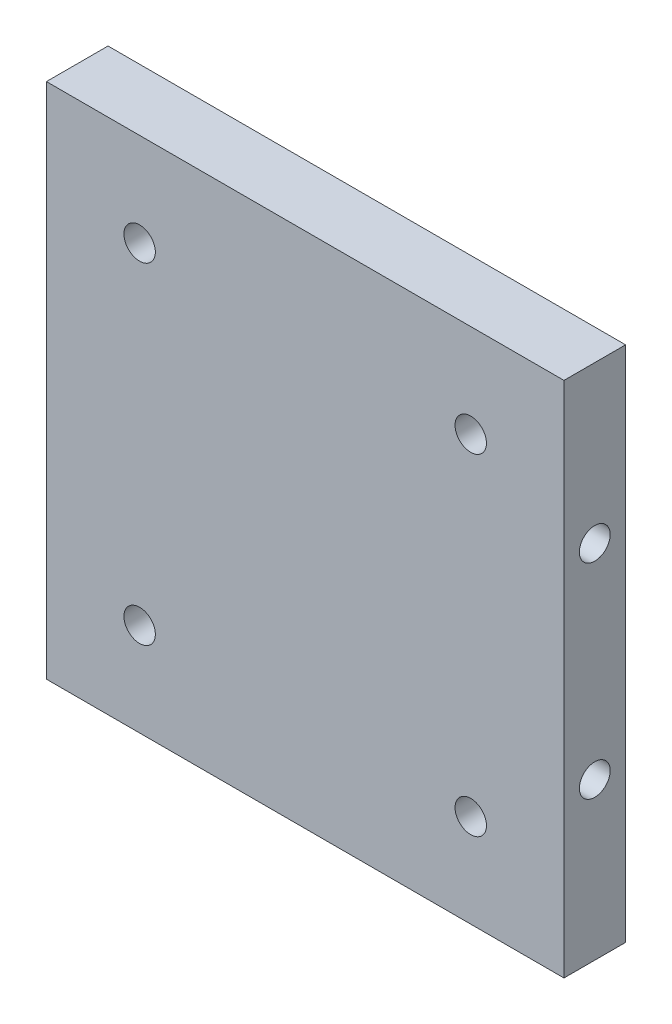
ISO-10303-21;
HEADER;
FILE_DESCRIPTION(('STEP AP214'),'2;1');
FILE_NAME('part.step','',(''),(''),'','','');
FILE_SCHEMA(('AUTOMOTIVE_DESIGN { 1 0 10303 214 1 1 1 1 }'));
ENDSEC;
DATA;
#1=APPLICATION_CONTEXT('core data for automotive mechanical design processes');
#2=APPLICATION_PROTOCOL_DEFINITION('international standard','automotive_design',2000,#1);
#3=PRODUCT_CONTEXT('',#1,'mechanical');
#4=PRODUCT('Part','Part','',(#3));
#5=PRODUCT_RELATED_PRODUCT_CATEGORY('part','',(#4));
#6=PRODUCT_DEFINITION_FORMATION('','',#4);
#7=PRODUCT_DEFINITION_CONTEXT('part definition',#1,'design');
#8=PRODUCT_DEFINITION('design','',#6,#7);
#9=PRODUCT_DEFINITION_SHAPE('','',#8);
#10=(LENGTH_UNIT() NAMED_UNIT(*) SI_UNIT(.MILLI.,.METRE.));
#11=(NAMED_UNIT(*) PLANE_ANGLE_UNIT() SI_UNIT($,.RADIAN.));
#12=(NAMED_UNIT(*) SI_UNIT($,.STERADIAN.) SOLID_ANGLE_UNIT());
#13=UNCERTAINTY_MEASURE_WITH_UNIT(LENGTH_MEASURE(1.E-05),#10,'distance_accuracy_value','');
#14=(GEOMETRIC_REPRESENTATION_CONTEXT(3) GLOBAL_UNCERTAINTY_ASSIGNED_CONTEXT((#13)) GLOBAL_UNIT_ASSIGNED_CONTEXT((#10,
#11,#12)) REPRESENTATION_CONTEXT('',''));
#15=CARTESIAN_POINT('',(0.,0.,0.));
#16=DIRECTION('',(0.,0.,1.));
#17=DIRECTION('',(1.,0.,0.));
#18=AXIS2_PLACEMENT_3D('',#15,#16,#17);
#19=CARTESIAN_POINT('',(21.,-21.,5.));
#20=DIRECTION('',(-1.,0.,0.));
#21=DIRECTION('',(0.,0.,1.));
#22=AXIS2_PLACEMENT_3D('',#19,#20,#21);
#23=PLANE('',#22);
#24=CARTESIAN_POINT('',(21.,-8.3,2.5));
#25=DIRECTION('',(1.,0.,0.));
#26=DIRECTION('',(0.,0.,-1.));
#27=AXIS2_PLACEMENT_3D('',#24,#25,#26);
#28=CIRCLE('',#27,1.24999999999999);
#29=CARTESIAN_POINT('',(21.,-8.3,1.25000000000001));
#30=VERTEX_POINT('',#29);
#31=EDGE_CURVE('E174',#30,#30,#28,.T.);
#32=ORIENTED_EDGE('',*,*,#31,.F.);
#33=EDGE_LOOP('',(#32));
#34=FACE_BOUND('',#33,.T.);
#35=CARTESIAN_POINT('',(21.,8.3,2.5));
#36=DIRECTION('',(1.,0.,0.));
#37=DIRECTION('',(0.,0.,-1.));
#38=AXIS2_PLACEMENT_3D('',#35,#36,#37);
#39=CIRCLE('',#38,1.24999999999999);
#40=CARTESIAN_POINT('',(21.,8.3,1.25000000000001));
#41=VERTEX_POINT('',#40);
#42=EDGE_CURVE('E166',#41,#41,#39,.T.);
#43=ORIENTED_EDGE('',*,*,#42,.F.);
#44=EDGE_LOOP('',(#43));
#45=FACE_BOUND('',#44,.T.);
#46=DIRECTION('',(0.,1.,0.));
#47=VECTOR('',#46,1.);
#48=CARTESIAN_POINT('',(21.,-21.,0.));
#49=LINE('',#48,#47);
#50=CARTESIAN_POINT('',(21.,-21.,0.));
#51=VERTEX_POINT('',#50);
#52=CARTESIAN_POINT('',(21.,21.,0.));
#53=VERTEX_POINT('',#52);
#54=EDGE_CURVE('E110',#51,#53,#49,.T.);
#55=ORIENTED_EDGE('',*,*,#54,.T.);
#56=DIRECTION('',(0.,0.,-1.));
#57=VECTOR('',#56,1.);
#58=CARTESIAN_POINT('',(21.,21.,5.));
#59=LINE('',#58,#57);
#60=CARTESIAN_POINT('',(21.,21.,5.));
#61=VERTEX_POINT('',#60);
#62=EDGE_CURVE('E11',#61,#53,#59,.T.);
#63=ORIENTED_EDGE('',*,*,#62,.F.);
#64=DIRECTION('',(0.,1.,0.));
#65=VECTOR('',#64,1.);
#66=CARTESIAN_POINT('',(21.,-21.,5.));
#67=LINE('',#66,#65);
#68=CARTESIAN_POINT('',(21.,-21.,5.));
#69=VERTEX_POINT('',#68);
#70=EDGE_CURVE('E94',#69,#61,#67,.T.);
#71=ORIENTED_EDGE('',*,*,#70,.F.);
#72=DIRECTION('',(0.,0.,-1.));
#73=VECTOR('',#72,1.);
#74=CARTESIAN_POINT('',(21.,-21.,5.));
#75=LINE('',#74,#73);
#76=EDGE_CURVE('E106',#69,#51,#75,.T.);
#77=ORIENTED_EDGE('',*,*,#76,.T.);
#78=EDGE_LOOP('',(#55,#63,#71,#77));
#79=FACE_BOUND('',#78,.T.);
#80=ADVANCED_FACE('F42',(#34,#45,#79),#23,.F.);
#81=CARTESIAN_POINT('',(-21.,21.,5.));
#82=DIRECTION('',(0.,-1.,0.));
#83=DIRECTION('',(0.,0.,-1.));
#84=AXIS2_PLACEMENT_3D('',#81,#82,#83);
#85=PLANE('',#84);
#86=DIRECTION('',(-1.,0.,0.));
#87=VECTOR('',#86,1.);
#88=CARTESIAN_POINT('',(-21.,21.,0.));
#89=LINE('',#88,#87);
#90=CARTESIAN_POINT('',(-21.,21.,0.));
#91=VERTEX_POINT('',#90);
#92=EDGE_CURVE('E99',#53,#91,#89,.T.);
#93=ORIENTED_EDGE('',*,*,#92,.T.);
#94=DIRECTION('',(0.,0.,-1.));
#95=VECTOR('',#94,1.);
#96=CARTESIAN_POINT('',(-21.,21.,5.));
#97=LINE('',#96,#95);
#98=CARTESIAN_POINT('',(-21.,21.,5.));
#99=VERTEX_POINT('',#98);
#100=EDGE_CURVE('E51',#99,#91,#97,.T.);
#101=ORIENTED_EDGE('',*,*,#100,.F.);
#102=DIRECTION('',(-1.,0.,0.));
#103=VECTOR('',#102,1.);
#104=CARTESIAN_POINT('',(-21.,21.,5.));
#105=LINE('',#104,#103);
#106=EDGE_CURVE('E89',#61,#99,#105,.T.);
#107=ORIENTED_EDGE('',*,*,#106,.F.);
#108=ORIENTED_EDGE('',*,*,#62,.T.);
#109=EDGE_LOOP('',(#93,#101,#107,#108));
#110=FACE_BOUND('',#109,.T.);
#111=ADVANCED_FACE('F98',(#110),#85,.F.);
#112=CARTESIAN_POINT('',(-21.,-21.,5.));
#113=DIRECTION('',(1.,0.,0.));
#114=DIRECTION('',(0.,0.,-1.));
#115=AXIS2_PLACEMENT_3D('',#112,#113,#114);
#116=PLANE('',#115);
#117=CARTESIAN_POINT('',(-21.,-8.3,2.5));
#118=DIRECTION('',(1.,0.,0.));
#119=DIRECTION('',(0.,0.,-1.));
#120=AXIS2_PLACEMENT_3D('',#117,#118,#119);
#121=CIRCLE('',#120,1.24999999999999);
#122=CARTESIAN_POINT('',(-21.,-8.3,1.25000000000001));
#123=VERTEX_POINT('',#122);
#124=EDGE_CURVE('E170',#123,#123,#121,.T.);
#125=ORIENTED_EDGE('',*,*,#124,.T.);
#126=EDGE_LOOP('',(#125));
#127=FACE_BOUND('',#126,.T.);
#128=CARTESIAN_POINT('',(-21.,8.3,2.5));
#129=DIRECTION('',(1.,0.,0.));
#130=DIRECTION('',(0.,0.,-1.));
#131=AXIS2_PLACEMENT_3D('',#128,#129,#130);
#132=CIRCLE('',#131,1.24999999999999);
#133=CARTESIAN_POINT('',(-21.,8.3,1.25000000000001));
#134=VERTEX_POINT('',#133);
#135=EDGE_CURVE('E144',#134,#134,#132,.T.);
#136=ORIENTED_EDGE('',*,*,#135,.T.);
#137=EDGE_LOOP('',(#136));
#138=FACE_BOUND('',#137,.T.);
#139=DIRECTION('',(0.,-1.,0.));
#140=VECTOR('',#139,1.);
#141=CARTESIAN_POINT('',(-21.,-21.,0.));
#142=LINE('',#141,#140);
#143=CARTESIAN_POINT('',(-21.,-21.,0.));
#144=VERTEX_POINT('',#143);
#145=EDGE_CURVE('E76',#91,#144,#142,.T.);
#146=ORIENTED_EDGE('',*,*,#145,.T.);
#147=DIRECTION('',(0.,0.,-1.));
#148=VECTOR('',#147,1.);
#149=CARTESIAN_POINT('',(-21.,-21.,5.));
#150=LINE('',#149,#148);
#151=CARTESIAN_POINT('',(-21.,-21.,5.));
#152=VERTEX_POINT('',#151);
#153=EDGE_CURVE('E101',#152,#144,#150,.T.);
#154=ORIENTED_EDGE('',*,*,#153,.F.);
#155=DIRECTION('',(0.,-1.,0.));
#156=VECTOR('',#155,1.);
#157=CARTESIAN_POINT('',(-21.,-21.,5.));
#158=LINE('',#157,#156);
#159=EDGE_CURVE('E92',#99,#152,#158,.T.);
#160=ORIENTED_EDGE('',*,*,#159,.F.);
#161=ORIENTED_EDGE('',*,*,#100,.T.);
#162=EDGE_LOOP('',(#146,#154,#160,#161));
#163=FACE_BOUND('',#162,.T.);
#164=ADVANCED_FACE('F102',(#127,#138,#163),#116,.F.);
#165=CARTESIAN_POINT('',(-21.,-21.,5.));
#166=DIRECTION('',(0.,1.,0.));
#167=DIRECTION('',(0.,0.,1.));
#168=AXIS2_PLACEMENT_3D('',#165,#166,#167);
#169=PLANE('',#168);
#170=DIRECTION('',(1.,0.,0.));
#171=VECTOR('',#170,1.);
#172=CARTESIAN_POINT('',(-21.,-21.,0.));
#173=LINE('',#172,#171);
#174=EDGE_CURVE('E82',#144,#51,#173,.T.);
#175=ORIENTED_EDGE('',*,*,#174,.T.);
#176=ORIENTED_EDGE('',*,*,#76,.F.);
#177=DIRECTION('',(1.,0.,0.));
#178=VECTOR('',#177,1.);
#179=CARTESIAN_POINT('',(-21.,-21.,5.));
#180=LINE('',#179,#178);
#181=EDGE_CURVE('E59',#152,#69,#180,.T.);
#182=ORIENTED_EDGE('',*,*,#181,.F.);
#183=ORIENTED_EDGE('',*,*,#153,.T.);
#184=EDGE_LOOP('',(#175,#176,#182,#183));
#185=FACE_BOUND('',#184,.T.);
#186=ADVANCED_FACE('F124',(#185),#169,.F.);
#187=CARTESIAN_POINT('',(0.,0.,5.));
#188=DIRECTION('',(0.,0.,-1.));
#189=DIRECTION('',(-1.,0.,0.));
#190=AXIS2_PLACEMENT_3D('',#187,#188,#189);
#191=PLANE('',#190);
#192=CARTESIAN_POINT('',(-13.4350288425443,13.4350288425445,5.));
#193=DIRECTION('',(0.,0.,1.));
#194=DIRECTION('',(1.,0.,0.));
#195=AXIS2_PLACEMENT_3D('',#192,#193,#194);
#196=CIRCLE('',#195,1.275);
#197=CARTESIAN_POINT('',(-12.1600288425443,13.4350288425445,5.));
#198=VERTEX_POINT('',#197);
#199=EDGE_CURVE('E139',#198,#198,#196,.T.);
#200=ORIENTED_EDGE('',*,*,#199,.F.);
#201=EDGE_LOOP('',(#200));
#202=FACE_BOUND('',#201,.T.);
#203=CARTESIAN_POINT('',(-13.4350288425445,-13.4350288425443,5.));
#204=DIRECTION('',(0.,0.,1.));
#205=DIRECTION('',(1.,0.,0.));
#206=AXIS2_PLACEMENT_3D('',#203,#204,#205);
#207=CIRCLE('',#206,1.275);
#208=CARTESIAN_POINT('',(-12.1600288425445,-13.4350288425443,5.));
#209=VERTEX_POINT('',#208);
#210=EDGE_CURVE('E148',#209,#209,#207,.T.);
#211=ORIENTED_EDGE('',*,*,#210,.F.);
#212=EDGE_LOOP('',(#211));
#213=FACE_BOUND('',#212,.T.);
#214=CARTESIAN_POINT('',(13.4350288425443,-13.4350288425445,5.));
#215=DIRECTION('',(0.,0.,1.));
#216=DIRECTION('',(1.,0.,0.));
#217=AXIS2_PLACEMENT_3D('',#214,#215,#216);
#218=CIRCLE('',#217,1.275);
#219=CARTESIAN_POINT('',(14.7100288425443,-13.4350288425445,5.));
#220=VERTEX_POINT('',#219);
#221=EDGE_CURVE('E156',#220,#220,#218,.T.);
#222=ORIENTED_EDGE('',*,*,#221,.F.);
#223=EDGE_LOOP('',(#222));
#224=FACE_BOUND('',#223,.T.);
#225=CARTESIAN_POINT('',(13.4350288425445,13.4350288425443,5.));
#226=DIRECTION('',(0.,0.,1.));
#227=DIRECTION('',(1.,0.,0.));
#228=AXIS2_PLACEMENT_3D('',#225,#226,#227);
#229=CIRCLE('',#228,1.275);
#230=CARTESIAN_POINT('',(14.7100288425445,13.4350288425443,5.));
#231=VERTEX_POINT('',#230);
#232=EDGE_CURVE('E131',#231,#231,#229,.T.);
#233=ORIENTED_EDGE('',*,*,#232,.F.);
#234=EDGE_LOOP('',(#233));
#235=FACE_BOUND('',#234,.T.);
#236=ORIENTED_EDGE('',*,*,#70,.T.);
#237=ORIENTED_EDGE('',*,*,#106,.T.);
#238=ORIENTED_EDGE('',*,*,#159,.T.);
#239=ORIENTED_EDGE('',*,*,#181,.T.);
#240=EDGE_LOOP('',(#236,#237,#238,#239));
#241=FACE_BOUND('',#240,.T.);
#242=ADVANCED_FACE('F90',(#202,#213,#224,#235,#241),#191,.F.);
#243=CARTESIAN_POINT('',(0.,0.,0.));
#244=DIRECTION('',(0.,0.,-1.));
#245=DIRECTION('',(-1.,0.,0.));
#246=AXIS2_PLACEMENT_3D('',#243,#244,#245);
#247=PLANE('',#246);
#248=CARTESIAN_POINT('',(-13.4350288425443,13.4350288425445,0.));
#249=DIRECTION('',(0.,0.,1.));
#250=DIRECTION('',(1.,0.,0.));
#251=AXIS2_PLACEMENT_3D('',#248,#249,#250);
#252=CIRCLE('',#251,1.275);
#253=CARTESIAN_POINT('',(-12.1600288425443,13.4350288425445,0.));
#254=VERTEX_POINT('',#253);
#255=EDGE_CURVE('E143',#254,#254,#252,.T.);
#256=ORIENTED_EDGE('',*,*,#255,.T.);
#257=EDGE_LOOP('',(#256));
#258=FACE_BOUND('',#257,.T.);
#259=CARTESIAN_POINT('',(-13.4350288425445,-13.4350288425443,0.));
#260=DIRECTION('',(0.,0.,1.));
#261=DIRECTION('',(1.,0.,0.));
#262=AXIS2_PLACEMENT_3D('',#259,#260,#261);
#263=CIRCLE('',#262,1.275);
#264=CARTESIAN_POINT('',(-12.1600288425445,-13.4350288425443,0.));
#265=VERTEX_POINT('',#264);
#266=EDGE_CURVE('E152',#265,#265,#263,.T.);
#267=ORIENTED_EDGE('',*,*,#266,.T.);
#268=EDGE_LOOP('',(#267));
#269=FACE_BOUND('',#268,.T.);
#270=CARTESIAN_POINT('',(13.4350288425443,-13.4350288425445,0.));
#271=DIRECTION('',(0.,0.,1.));
#272=DIRECTION('',(1.,0.,0.));
#273=AXIS2_PLACEMENT_3D('',#270,#271,#272);
#274=CIRCLE('',#273,1.275);
#275=CARTESIAN_POINT('',(14.7100288425443,-13.4350288425445,0.));
#276=VERTEX_POINT('',#275);
#277=EDGE_CURVE('E135',#276,#276,#274,.T.);
#278=ORIENTED_EDGE('',*,*,#277,.T.);
#279=EDGE_LOOP('',(#278));
#280=FACE_BOUND('',#279,.T.);
#281=CARTESIAN_POINT('',(13.4350288425445,13.4350288425443,0.));
#282=DIRECTION('',(0.,0.,1.));
#283=DIRECTION('',(1.,0.,0.));
#284=AXIS2_PLACEMENT_3D('',#281,#282,#283);
#285=CIRCLE('',#284,1.275);
#286=CARTESIAN_POINT('',(14.7100288425445,13.4350288425443,0.));
#287=VERTEX_POINT('',#286);
#288=EDGE_CURVE('E114',#287,#287,#285,.T.);
#289=ORIENTED_EDGE('',*,*,#288,.T.);
#290=EDGE_LOOP('',(#289));
#291=FACE_BOUND('',#290,.T.);
#292=ORIENTED_EDGE('',*,*,#54,.F.);
#293=ORIENTED_EDGE('',*,*,#174,.F.);
#294=ORIENTED_EDGE('',*,*,#145,.F.);
#295=ORIENTED_EDGE('',*,*,#92,.F.);
#296=EDGE_LOOP('',(#292,#293,#294,#295));
#297=FACE_BOUND('',#296,.T.);
#298=ADVANCED_FACE('F127',(#258,#269,#280,#291,#297),#247,.T.);
#299=CARTESIAN_POINT('',(13.4350288425445,13.4350288425443,0.));
#300=DIRECTION('',(0.,0.,1.));
#301=DIRECTION('',(1.,0.,0.));
#302=AXIS2_PLACEMENT_3D('',#299,#300,#301);
#303=CYLINDRICAL_SURFACE('',#302,1.275);
#304=ORIENTED_EDGE('',*,*,#288,.F.);
#305=EDGE_LOOP('',(#304));
#306=FACE_BOUND('',#305,.T.);
#307=ORIENTED_EDGE('',*,*,#232,.T.);
#308=EDGE_LOOP('',(#307));
#309=FACE_BOUND('',#308,.T.);
#310=ADVANCED_FACE('F204',(#306,#309),#303,.F.);
#311=CARTESIAN_POINT('',(13.4350288425443,-13.4350288425445,0.));
#312=DIRECTION('',(0.,0.,1.));
#313=DIRECTION('',(1.,0.,0.));
#314=AXIS2_PLACEMENT_3D('',#311,#312,#313);
#315=CYLINDRICAL_SURFACE('',#314,1.275);
#316=ORIENTED_EDGE('',*,*,#277,.F.);
#317=EDGE_LOOP('',(#316));
#318=FACE_BOUND('',#317,.T.);
#319=ORIENTED_EDGE('',*,*,#221,.T.);
#320=EDGE_LOOP('',(#319));
#321=FACE_BOUND('',#320,.T.);
#322=ADVANCED_FACE('F201',(#318,#321),#315,.F.);
#323=CARTESIAN_POINT('',(-13.4350288425445,-13.4350288425443,0.));
#324=DIRECTION('',(0.,0.,1.));
#325=DIRECTION('',(1.,0.,0.));
#326=AXIS2_PLACEMENT_3D('',#323,#324,#325);
#327=CYLINDRICAL_SURFACE('',#326,1.275);
#328=ORIENTED_EDGE('',*,*,#266,.F.);
#329=EDGE_LOOP('',(#328));
#330=FACE_BOUND('',#329,.T.);
#331=ORIENTED_EDGE('',*,*,#210,.T.);
#332=EDGE_LOOP('',(#331));
#333=FACE_BOUND('',#332,.T.);
#334=ADVANCED_FACE('F196',(#330,#333),#327,.F.);
#335=CARTESIAN_POINT('',(-13.4350288425443,13.4350288425445,0.));
#336=DIRECTION('',(0.,0.,1.));
#337=DIRECTION('',(1.,0.,0.));
#338=AXIS2_PLACEMENT_3D('',#335,#336,#337);
#339=CYLINDRICAL_SURFACE('',#338,1.275);
#340=ORIENTED_EDGE('',*,*,#255,.F.);
#341=EDGE_LOOP('',(#340));
#342=FACE_BOUND('',#341,.T.);
#343=ORIENTED_EDGE('',*,*,#199,.T.);
#344=EDGE_LOOP('',(#343));
#345=FACE_BOUND('',#344,.T.);
#346=ADVANCED_FACE('F187',(#342,#345),#339,.F.);
#347=CARTESIAN_POINT('',(21.,8.3,2.5));
#348=DIRECTION('',(1.,0.,0.));
#349=DIRECTION('',(0.,0.,-1.));
#350=AXIS2_PLACEMENT_3D('',#347,#348,#349);
#351=CYLINDRICAL_SURFACE('',#350,1.24999999999999);
#352=ORIENTED_EDGE('',*,*,#135,.F.);
#353=EDGE_LOOP('',(#352));
#354=FACE_BOUND('',#353,.T.);
#355=ORIENTED_EDGE('',*,*,#42,.T.);
#356=EDGE_LOOP('',(#355));
#357=FACE_BOUND('',#356,.T.);
#358=ADVANCED_FACE('F185',(#354,#357),#351,.F.);
#359=CARTESIAN_POINT('',(21.,-8.3,2.5));
#360=DIRECTION('',(1.,0.,0.));
#361=DIRECTION('',(0.,0.,-1.));
#362=AXIS2_PLACEMENT_3D('',#359,#360,#361);
#363=CYLINDRICAL_SURFACE('',#362,1.24999999999999);
#364=ORIENTED_EDGE('',*,*,#124,.F.);
#365=EDGE_LOOP('',(#364));
#366=FACE_BOUND('',#365,.T.);
#367=ORIENTED_EDGE('',*,*,#31,.T.);
#368=EDGE_LOOP('',(#367));
#369=FACE_BOUND('',#368,.T.);
#370=ADVANCED_FACE('F179',(#366,#369),#363,.F.);
#371=CLOSED_SHELL('',(#80,#111,#164,#186,#242,#298,#310,#322,#334,#346,#358,#370));
#372=MANIFOLD_SOLID_BREP('B2',#371);
#373=ADVANCED_BREP_SHAPE_REPRESENTATION('',(#18,#372),#14);
#374=SHAPE_DEFINITION_REPRESENTATION(#9,#373);
ENDSEC;
END-ISO-10303-21;
